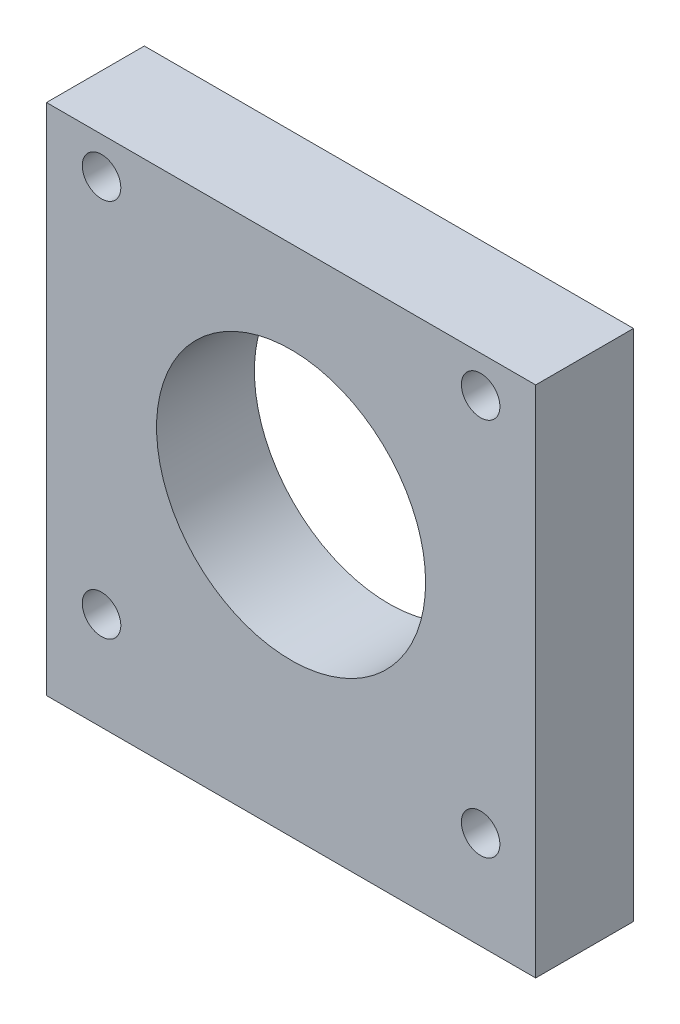
ISO-10303-21;
HEADER;
FILE_DESCRIPTION(('STEP AP214'),'2;1');
FILE_NAME('part.step','',(''),(''),'','','');
FILE_SCHEMA(('AUTOMOTIVE_DESIGN { 1 0 10303 214 1 1 1 1 }'));
ENDSEC;
DATA;
#1=APPLICATION_CONTEXT('core data for automotive mechanical design processes');
#2=APPLICATION_PROTOCOL_DEFINITION('international standard','automotive_design',2000,#1);
#3=PRODUCT_CONTEXT('',#1,'mechanical');
#4=PRODUCT('Part','Part','',(#3));
#5=PRODUCT_RELATED_PRODUCT_CATEGORY('part','',(#4));
#6=PRODUCT_DEFINITION_FORMATION('','',#4);
#7=PRODUCT_DEFINITION_CONTEXT('part definition',#1,'design');
#8=PRODUCT_DEFINITION('design','',#6,#7);
#9=PRODUCT_DEFINITION_SHAPE('','',#8);
#10=(LENGTH_UNIT() NAMED_UNIT(*) SI_UNIT(.MILLI.,.METRE.));
#11=(NAMED_UNIT(*) PLANE_ANGLE_UNIT() SI_UNIT($,.RADIAN.));
#12=(NAMED_UNIT(*) SI_UNIT($,.STERADIAN.) SOLID_ANGLE_UNIT());
#13=UNCERTAINTY_MEASURE_WITH_UNIT(LENGTH_MEASURE(1.E-05),#10,'distance_accuracy_value','');
#14=(GEOMETRIC_REPRESENTATION_CONTEXT(3) GLOBAL_UNCERTAINTY_ASSIGNED_CONTEXT((#13)) GLOBAL_UNIT_ASSIGNED_CONTEXT((#10,
#11,#12)) REPRESENTATION_CONTEXT('',''));
#15=CARTESIAN_POINT('',(0.,0.,0.));
#16=DIRECTION('',(0.,0.,1.));
#17=DIRECTION('',(1.,0.,0.));
#18=AXIS2_PLACEMENT_3D('',#15,#16,#17);
#19=CARTESIAN_POINT('',(-20.,-21.,8.));
#20=DIRECTION('',(1.,0.,0.));
#21=DIRECTION('',(0.,0.,-1.));
#22=AXIS2_PLACEMENT_3D('',#19,#20,#21);
#23=PLANE('',#22);
#24=DIRECTION('',(0.,-1.,0.));
#25=VECTOR('',#24,1.);
#26=CARTESIAN_POINT('',(-20.,-21.,0.));
#27=LINE('',#26,#25);
#28=CARTESIAN_POINT('',(-20.,21.,0.));
#29=VERTEX_POINT('',#28);
#30=CARTESIAN_POINT('',(-20.,-21.,0.));
#31=VERTEX_POINT('',#30);
#32=EDGE_CURVE('E135',#29,#31,#27,.T.);
#33=ORIENTED_EDGE('',*,*,#32,.T.);
#34=DIRECTION('',(0.,0.,-1.));
#35=VECTOR('',#34,1.);
#36=CARTESIAN_POINT('',(-20.,-21.,8.));
#37=LINE('',#36,#35);
#38=CARTESIAN_POINT('',(-20.,-21.,8.));
#39=VERTEX_POINT('',#38);
#40=EDGE_CURVE('E11',#39,#31,#37,.T.);
#41=ORIENTED_EDGE('',*,*,#40,.F.);
#42=DIRECTION('',(0.,-1.,0.));
#43=VECTOR('',#42,1.);
#44=CARTESIAN_POINT('',(-20.,-21.,8.));
#45=LINE('',#44,#43);
#46=CARTESIAN_POINT('',(-20.,21.,8.));
#47=VERTEX_POINT('',#46);
#48=EDGE_CURVE('E139',#47,#39,#45,.T.);
#49=ORIENTED_EDGE('',*,*,#48,.F.);
#50=DIRECTION('',(0.,0.,-1.));
#51=VECTOR('',#50,1.);
#52=CARTESIAN_POINT('',(-20.,21.,8.));
#53=LINE('',#52,#51);
#54=EDGE_CURVE('E149',#47,#29,#53,.T.);
#55=ORIENTED_EDGE('',*,*,#54,.T.);
#56=EDGE_LOOP('',(#33,#41,#49,#55));
#57=FACE_BOUND('',#56,.T.);
#58=ADVANCED_FACE('F44',(#57),#23,.F.);
#59=CARTESIAN_POINT('',(20.,-21.,8.));
#60=DIRECTION('',(0.,1.,0.));
#61=DIRECTION('',(-1.,0.,0.));
#62=AXIS2_PLACEMENT_3D('',#59,#60,#61);
#63=PLANE('',#62);
#64=CARTESIAN_POINT('',(12.,-21.,4.));
#65=DIRECTION('',(0.,-1.,0.));
#66=DIRECTION('',(0.,0.,-1.));
#67=AXIS2_PLACEMENT_3D('',#64,#65,#66);
#68=CIRCLE('',#67,1.883);
#69=CARTESIAN_POINT('',(12.,-21.,2.117));
#70=VERTEX_POINT('',#69);
#71=EDGE_CURVE('E119',#70,#70,#68,.T.);
#72=ORIENTED_EDGE('',*,*,#71,.F.);
#73=EDGE_LOOP('',(#72));
#74=FACE_BOUND('',#73,.T.);
#75=CARTESIAN_POINT('',(-12.,-21.,4.));
#76=DIRECTION('',(0.,-1.,0.));
#77=DIRECTION('',(0.,0.,-1.));
#78=AXIS2_PLACEMENT_3D('',#75,#76,#77);
#79=CIRCLE('',#78,1.883);
#80=CARTESIAN_POINT('',(-12.,-21.,2.117));
#81=VERTEX_POINT('',#80);
#82=EDGE_CURVE('E110',#81,#81,#79,.T.);
#83=ORIENTED_EDGE('',*,*,#82,.F.);
#84=EDGE_LOOP('',(#83));
#85=FACE_BOUND('',#84,.T.);
#86=DIRECTION('',(1.,0.,0.));
#87=VECTOR('',#86,1.);
#88=CARTESIAN_POINT('',(20.,-21.,0.));
#89=LINE('',#88,#87);
#90=CARTESIAN_POINT('',(20.,-21.,0.));
#91=VERTEX_POINT('',#90);
#92=EDGE_CURVE('E153',#31,#91,#89,.T.);
#93=ORIENTED_EDGE('',*,*,#92,.T.);
#94=DIRECTION('',(0.,0.,-1.));
#95=VECTOR('',#94,1.);
#96=CARTESIAN_POINT('',(20.,-21.,8.));
#97=LINE('',#96,#95);
#98=CARTESIAN_POINT('',(20.,-21.,8.));
#99=VERTEX_POINT('',#98);
#100=EDGE_CURVE('E53',#99,#91,#97,.T.);
#101=ORIENTED_EDGE('',*,*,#100,.F.);
#102=DIRECTION('',(1.,0.,0.));
#103=VECTOR('',#102,1.);
#104=CARTESIAN_POINT('',(20.,-21.,8.));
#105=LINE('',#104,#103);
#106=EDGE_CURVE('E92',#39,#99,#105,.T.);
#107=ORIENTED_EDGE('',*,*,#106,.F.);
#108=ORIENTED_EDGE('',*,*,#40,.T.);
#109=EDGE_LOOP('',(#93,#101,#107,#108));
#110=FACE_BOUND('',#109,.T.);
#111=ADVANCED_FACE('F183',(#74,#85,#110),#63,.F.);
#112=CARTESIAN_POINT('',(20.,-21.,8.));
#113=DIRECTION('',(-1.,0.,0.));
#114=DIRECTION('',(0.,0.,1.));
#115=AXIS2_PLACEMENT_3D('',#112,#113,#114);
#116=PLANE('',#115);
#117=DIRECTION('',(0.,1.,0.));
#118=VECTOR('',#117,1.);
#119=CARTESIAN_POINT('',(20.,-21.,0.));
#120=LINE('',#119,#118);
#121=CARTESIAN_POINT('',(20.,21.,0.));
#122=VERTEX_POINT('',#121);
#123=EDGE_CURVE('E79',#91,#122,#120,.T.);
#124=ORIENTED_EDGE('',*,*,#123,.T.);
#125=DIRECTION('',(0.,0.,-1.));
#126=VECTOR('',#125,1.);
#127=CARTESIAN_POINT('',(20.,21.,8.));
#128=LINE('',#127,#126);
#129=CARTESIAN_POINT('',(20.,21.,8.));
#130=VERTEX_POINT('',#129);
#131=EDGE_CURVE('E162',#130,#122,#128,.T.);
#132=ORIENTED_EDGE('',*,*,#131,.F.);
#133=DIRECTION('',(0.,1.,0.));
#134=VECTOR('',#133,1.);
#135=CARTESIAN_POINT('',(20.,-21.,8.));
#136=LINE('',#135,#134);
#137=EDGE_CURVE('E144',#99,#130,#136,.T.);
#138=ORIENTED_EDGE('',*,*,#137,.F.);
#139=ORIENTED_EDGE('',*,*,#100,.T.);
#140=EDGE_LOOP('',(#124,#132,#138,#139));
#141=FACE_BOUND('',#140,.T.);
#142=ADVANCED_FACE('F166',(#141),#116,.F.);
#143=CARTESIAN_POINT('',(20.,21.,8.));
#144=DIRECTION('',(0.,-1.,0.));
#145=DIRECTION('',(1.,0.,0.));
#146=AXIS2_PLACEMENT_3D('',#143,#144,#145);
#147=PLANE('',#146);
#148=DIRECTION('',(-1.,0.,0.));
#149=VECTOR('',#148,1.);
#150=CARTESIAN_POINT('',(20.,21.,0.));
#151=LINE('',#150,#149);
#152=EDGE_CURVE('E85',#122,#29,#151,.T.);
#153=ORIENTED_EDGE('',*,*,#152,.T.);
#154=ORIENTED_EDGE('',*,*,#54,.F.);
#155=DIRECTION('',(-1.,0.,0.));
#156=VECTOR('',#155,1.);
#157=CARTESIAN_POINT('',(20.,21.,8.));
#158=LINE('',#157,#156);
#159=EDGE_CURVE('E61',#130,#47,#158,.T.);
#160=ORIENTED_EDGE('',*,*,#159,.F.);
#161=ORIENTED_EDGE('',*,*,#131,.T.);
#162=EDGE_LOOP('',(#153,#154,#160,#161));
#163=FACE_BOUND('',#162,.T.);
#164=ADVANCED_FACE('F173',(#163),#147,.F.);
#165=CARTESIAN_POINT('',(0.,0.,8.));
#166=DIRECTION('',(0.,0.,1.));
#167=DIRECTION('',(1.,0.,0.));
#168=AXIS2_PLACEMENT_3D('',#165,#166,#167);
#169=PLANE('',#168);
#170=CARTESIAN_POINT('',(15.5,18.,8.));
#171=DIRECTION('',(0.,0.,-1.));
#172=DIRECTION('',(-1.,0.,0.));
#173=AXIS2_PLACEMENT_3D('',#170,#171,#172);
#174=CIRCLE('',#173,1.575);
#175=CARTESIAN_POINT('',(13.925,18.,8.));
#176=VERTEX_POINT('',#175);
#177=EDGE_CURVE('E311',#176,#176,#174,.T.);
#178=ORIENTED_EDGE('',*,*,#177,.T.);
#179=EDGE_LOOP('',(#178));
#180=FACE_BOUND('',#179,.T.);
#181=CARTESIAN_POINT('',(-15.5,18.,8.));
#182=DIRECTION('',(0.,0.,-1.));
#183=DIRECTION('',(-1.,0.,0.));
#184=AXIS2_PLACEMENT_3D('',#181,#182,#183);
#185=CIRCLE('',#184,1.575);
#186=CARTESIAN_POINT('',(-17.075,18.,8.));
#187=VERTEX_POINT('',#186);
#188=EDGE_CURVE('E323',#187,#187,#185,.T.);
#189=ORIENTED_EDGE('',*,*,#188,.T.);
#190=EDGE_LOOP('',(#189));
#191=FACE_BOUND('',#190,.T.);
#192=CARTESIAN_POINT('',(15.5,-13.,8.));
#193=DIRECTION('',(0.,0.,-1.));
#194=DIRECTION('',(-1.,0.,0.));
#195=AXIS2_PLACEMENT_3D('',#192,#193,#194);
#196=CIRCLE('',#195,1.575);
#197=CARTESIAN_POINT('',(13.925,-13.,8.));
#198=VERTEX_POINT('',#197);
#199=EDGE_CURVE('E244',#198,#198,#196,.T.);
#200=ORIENTED_EDGE('',*,*,#199,.T.);
#201=EDGE_LOOP('',(#200));
#202=FACE_BOUND('',#201,.T.);
#203=CARTESIAN_POINT('',(-15.5,-13.,8.));
#204=DIRECTION('',(0.,0.,-1.));
#205=DIRECTION('',(-1.,0.,0.));
#206=AXIS2_PLACEMENT_3D('',#203,#204,#205);
#207=CIRCLE('',#206,1.575);
#208=CARTESIAN_POINT('',(-17.075,-13.,8.));
#209=VERTEX_POINT('',#208);
#210=EDGE_CURVE('E249',#209,#209,#207,.T.);
#211=ORIENTED_EDGE('',*,*,#210,.T.);
#212=EDGE_LOOP('',(#211));
#213=FACE_BOUND('',#212,.T.);
#214=CARTESIAN_POINT('',(0.,2.49999999999999,8.));
#215=DIRECTION('',(0.,0.,1.));
#216=DIRECTION('',(1.,0.,0.));
#217=AXIS2_PLACEMENT_3D('',#214,#215,#216);
#218=CIRCLE('',#217,11.);
#219=CARTESIAN_POINT('',(11.,2.49999999999999,8.));
#220=VERTEX_POINT('',#219);
#221=EDGE_CURVE('E130',#220,#220,#218,.T.);
#222=ORIENTED_EDGE('',*,*,#221,.F.);
#223=EDGE_LOOP('',(#222));
#224=FACE_BOUND('',#223,.T.);
#225=ORIENTED_EDGE('',*,*,#48,.T.);
#226=ORIENTED_EDGE('',*,*,#106,.T.);
#227=ORIENTED_EDGE('',*,*,#137,.T.);
#228=ORIENTED_EDGE('',*,*,#159,.T.);
#229=EDGE_LOOP('',(#225,#226,#227,#228));
#230=FACE_BOUND('',#229,.T.);
#231=ADVANCED_FACE('F175',(#180,#191,#202,#213,#224,#230),#169,.T.);
#232=CARTESIAN_POINT('',(0.,0.,0.));
#233=DIRECTION('',(0.,0.,1.));
#234=DIRECTION('',(1.,0.,0.));
#235=AXIS2_PLACEMENT_3D('',#232,#233,#234);
#236=PLANE('',#235);
#237=CARTESIAN_POINT('',(15.5,18.,0.));
#238=DIRECTION('',(0.,0.,-1.));
#239=DIRECTION('',(-1.,0.,0.));
#240=AXIS2_PLACEMENT_3D('',#237,#238,#239);
#241=CIRCLE('',#240,1.883);
#242=CARTESIAN_POINT('',(13.617,18.,0.));
#243=VERTEX_POINT('',#242);
#244=EDGE_CURVE('E224',#243,#243,#241,.T.);
#245=ORIENTED_EDGE('',*,*,#244,.F.);
#246=EDGE_LOOP('',(#245));
#247=FACE_BOUND('',#246,.T.);
#248=CARTESIAN_POINT('',(-15.5,18.,0.));
#249=DIRECTION('',(0.,0.,-1.));
#250=DIRECTION('',(-1.,0.,0.));
#251=AXIS2_PLACEMENT_3D('',#248,#249,#250);
#252=CIRCLE('',#251,1.883);
#253=CARTESIAN_POINT('',(-17.383,18.,0.));
#254=VERTEX_POINT('',#253);
#255=EDGE_CURVE('E228',#254,#254,#252,.T.);
#256=ORIENTED_EDGE('',*,*,#255,.F.);
#257=EDGE_LOOP('',(#256));
#258=FACE_BOUND('',#257,.T.);
#259=CARTESIAN_POINT('',(15.5,-13.,0.));
#260=DIRECTION('',(0.,0.,-1.));
#261=DIRECTION('',(-1.,0.,0.));
#262=AXIS2_PLACEMENT_3D('',#259,#260,#261);
#263=CIRCLE('',#262,1.883);
#264=CARTESIAN_POINT('',(13.617,-13.,0.));
#265=VERTEX_POINT('',#264);
#266=EDGE_CURVE('E232',#265,#265,#263,.T.);
#267=ORIENTED_EDGE('',*,*,#266,.F.);
#268=EDGE_LOOP('',(#267));
#269=FACE_BOUND('',#268,.T.);
#270=CARTESIAN_POINT('',(-15.5,-13.,0.));
#271=DIRECTION('',(0.,0.,-1.));
#272=DIRECTION('',(-1.,0.,0.));
#273=AXIS2_PLACEMENT_3D('',#270,#271,#272);
#274=CIRCLE('',#273,1.883);
#275=CARTESIAN_POINT('',(-17.383,-13.,0.));
#276=VERTEX_POINT('',#275);
#277=EDGE_CURVE('E236',#276,#276,#274,.T.);
#278=ORIENTED_EDGE('',*,*,#277,.F.);
#279=EDGE_LOOP('',(#278));
#280=FACE_BOUND('',#279,.T.);
#281=CARTESIAN_POINT('',(0.,2.49999999999999,0.));
#282=DIRECTION('',(0.,0.,1.));
#283=DIRECTION('',(1.,0.,0.));
#284=AXIS2_PLACEMENT_3D('',#281,#282,#283);
#285=CIRCLE('',#284,11.);
#286=CARTESIAN_POINT('',(11.,2.49999999999999,0.));
#287=VERTEX_POINT('',#286);
#288=EDGE_CURVE('E131',#287,#287,#285,.T.);
#289=ORIENTED_EDGE('',*,*,#288,.T.);
#290=EDGE_LOOP('',(#289));
#291=FACE_BOUND('',#290,.T.);
#292=ORIENTED_EDGE('',*,*,#32,.F.);
#293=ORIENTED_EDGE('',*,*,#152,.F.);
#294=ORIENTED_EDGE('',*,*,#123,.F.);
#295=ORIENTED_EDGE('',*,*,#92,.F.);
#296=EDGE_LOOP('',(#292,#293,#294,#295));
#297=FACE_BOUND('',#296,.T.);
#298=ADVANCED_FACE('F169',(#247,#258,#269,#280,#291,#297),#236,.F.);
#299=CARTESIAN_POINT('',(0.,2.49999999999999,0.));
#300=DIRECTION('',(0.,0.,1.));
#301=DIRECTION('',(1.,0.,0.));
#302=AXIS2_PLACEMENT_3D('',#299,#300,#301);
#303=CYLINDRICAL_SURFACE('',#302,11.);
#304=ORIENTED_EDGE('',*,*,#288,.F.);
#305=EDGE_LOOP('',(#304));
#306=FACE_BOUND('',#305,.T.);
#307=ORIENTED_EDGE('',*,*,#221,.T.);
#308=EDGE_LOOP('',(#307));
#309=FACE_BOUND('',#308,.T.);
#310=ADVANCED_FACE('F213',(#306,#309),#303,.F.);
#311=CARTESIAN_POINT('',(-12.,-11.,4.));
#312=DIRECTION('',(0.,-1.,0.));
#313=DIRECTION('',(0.,0.,-1.));
#314=AXIS2_PLACEMENT_3D('',#311,#312,#313);
#315=CONICAL_SURFACE('',#314,1.575,1.02974425867665);
#316=CARTESIAN_POINT('',(-12.,-10.0536445250316,4.));
#317=VERTEX_POINT('',#316);
#318=VERTEX_LOOP('',#317);
#319=FACE_BOUND('',#318,.T.);
#320=CARTESIAN_POINT('',(-12.,-11.,4.));
#321=DIRECTION('',(0.,-1.,0.));
#322=DIRECTION('',(0.,0.,-1.));
#323=AXIS2_PLACEMENT_3D('',#320,#321,#322);
#324=CIRCLE('',#323,1.575);
#325=CARTESIAN_POINT('',(-12.,-11.,2.425));
#326=VERTEX_POINT('',#325);
#327=EDGE_CURVE('E126',#326,#326,#324,.T.);
#328=ORIENTED_EDGE('',*,*,#327,.T.);
#329=EDGE_LOOP('',(#328));
#330=FACE_BOUND('',#329,.T.);
#331=ADVANCED_FACE('F205',(#319,#330),#315,.F.);
#332=CARTESIAN_POINT('',(-12.,-21.,4.));
#333=DIRECTION('',(0.,-1.,0.));
#334=DIRECTION('',(0.,0.,-1.));
#335=AXIS2_PLACEMENT_3D('',#332,#333,#334);
#336=CYLINDRICAL_SURFACE('',#335,1.575);
#337=ORIENTED_EDGE('',*,*,#327,.F.);
#338=EDGE_LOOP('',(#337));
#339=FACE_BOUND('',#338,.T.);
#340=CARTESIAN_POINT('',(-12.,-20.692,4.));
#341=DIRECTION('',(0.,-1.,0.));
#342=DIRECTION('',(0.,0.,-1.));
#343=AXIS2_PLACEMENT_3D('',#340,#341,#342);
#344=CIRCLE('',#343,1.575);
#345=CARTESIAN_POINT('',(-12.,-20.692,2.425));
#346=VERTEX_POINT('',#345);
#347=EDGE_CURVE('E116',#346,#346,#344,.T.);
#348=ORIENTED_EDGE('',*,*,#347,.T.);
#349=EDGE_LOOP('',(#348));
#350=FACE_BOUND('',#349,.T.);
#351=ADVANCED_FACE('F199',(#339,#350),#336,.F.);
#352=CARTESIAN_POINT('',(-12.,-21.,4.));
#353=DIRECTION('',(0.,-1.,0.));
#354=DIRECTION('',(0.,0.,-1.));
#355=AXIS2_PLACEMENT_3D('',#352,#353,#354);
#356=CONICAL_SURFACE('',#355,1.883,0.785398163397443);
#357=ORIENTED_EDGE('',*,*,#347,.F.);
#358=EDGE_LOOP('',(#357));
#359=FACE_BOUND('',#358,.T.);
#360=ORIENTED_EDGE('',*,*,#82,.T.);
#361=EDGE_LOOP('',(#360));
#362=FACE_BOUND('',#361,.T.);
#363=ADVANCED_FACE('F103',(#359,#362),#356,.F.);
#364=CARTESIAN_POINT('',(12.,-11.,4.));
#365=DIRECTION('',(0.,-1.,0.));
#366=DIRECTION('',(0.,0.,-1.));
#367=AXIS2_PLACEMENT_3D('',#364,#365,#366);
#368=CONICAL_SURFACE('',#367,1.575,1.02974425867665);
#369=CARTESIAN_POINT('',(12.,-10.0536445250316,4.));
#370=VERTEX_POINT('',#369);
#371=VERTEX_LOOP('',#370);
#372=FACE_BOUND('',#371,.T.);
#373=CARTESIAN_POINT('',(12.,-11.,4.));
#374=DIRECTION('',(0.,-1.,0.));
#375=DIRECTION('',(0.,0.,-1.));
#376=AXIS2_PLACEMENT_3D('',#373,#374,#375);
#377=CIRCLE('',#376,1.575);
#378=CARTESIAN_POINT('',(12.,-11.,2.425));
#379=VERTEX_POINT('',#378);
#380=EDGE_CURVE('E107',#379,#379,#377,.T.);
#381=ORIENTED_EDGE('',*,*,#380,.T.);
#382=EDGE_LOOP('',(#381));
#383=FACE_BOUND('',#382,.T.);
#384=ADVANCED_FACE('F99',(#372,#383),#368,.F.);
#385=CARTESIAN_POINT('',(12.,-21.,4.));
#386=DIRECTION('',(0.,-1.,0.));
#387=DIRECTION('',(0.,0.,-1.));
#388=AXIS2_PLACEMENT_3D('',#385,#386,#387);
#389=CYLINDRICAL_SURFACE('',#388,1.575);
#390=ORIENTED_EDGE('',*,*,#380,.F.);
#391=EDGE_LOOP('',(#390));
#392=FACE_BOUND('',#391,.T.);
#393=CARTESIAN_POINT('',(12.,-20.692,4.));
#394=DIRECTION('',(0.,-1.,0.));
#395=DIRECTION('',(0.,0.,-1.));
#396=AXIS2_PLACEMENT_3D('',#393,#394,#395);
#397=CIRCLE('',#396,1.575);
#398=CARTESIAN_POINT('',(12.,-20.692,2.425));
#399=VERTEX_POINT('',#398);
#400=EDGE_CURVE('E111',#399,#399,#397,.T.);
#401=ORIENTED_EDGE('',*,*,#400,.T.);
#402=EDGE_LOOP('',(#401));
#403=FACE_BOUND('',#402,.T.);
#404=ADVANCED_FACE('F102',(#392,#403),#389,.F.);
#405=CARTESIAN_POINT('',(12.,-21.,4.));
#406=DIRECTION('',(0.,-1.,0.));
#407=DIRECTION('',(0.,0.,-1.));
#408=AXIS2_PLACEMENT_3D('',#405,#406,#407);
#409=CONICAL_SURFACE('',#408,1.883,0.785398163397443);
#410=ORIENTED_EDGE('',*,*,#400,.F.);
#411=EDGE_LOOP('',(#410));
#412=FACE_BOUND('',#411,.T.);
#413=ORIENTED_EDGE('',*,*,#71,.T.);
#414=EDGE_LOOP('',(#413));
#415=FACE_BOUND('',#414,.T.);
#416=ADVANCED_FACE('F260',(#412,#415),#409,.F.);
#417=CARTESIAN_POINT('',(-15.5,-13.,0.));
#418=DIRECTION('',(0.,0.,-1.));
#419=DIRECTION('',(-1.,0.,0.));
#420=AXIS2_PLACEMENT_3D('',#417,#418,#419);
#421=CYLINDRICAL_SURFACE('',#420,1.575);
#422=ORIENTED_EDGE('',*,*,#210,.F.);
#423=EDGE_LOOP('',(#422));
#424=FACE_BOUND('',#423,.T.);
#425=CARTESIAN_POINT('',(-15.5,-13.,0.308));
#426=DIRECTION('',(0.,0.,-1.));
#427=DIRECTION('',(-1.,0.,0.));
#428=AXIS2_PLACEMENT_3D('',#425,#426,#427);
#429=CIRCLE('',#428,1.575);
#430=CARTESIAN_POINT('',(-17.075,-13.,0.308));
#431=VERTEX_POINT('',#430);
#432=EDGE_CURVE('E243',#431,#431,#429,.T.);
#433=ORIENTED_EDGE('',*,*,#432,.T.);
#434=EDGE_LOOP('',(#433));
#435=FACE_BOUND('',#434,.T.);
#436=ADVANCED_FACE('F262',(#424,#435),#421,.F.);
#437=CARTESIAN_POINT('',(-15.5,-13.,0.));
#438=DIRECTION('',(0.,0.,-1.));
#439=DIRECTION('',(-1.,0.,0.));
#440=AXIS2_PLACEMENT_3D('',#437,#438,#439);
#441=CONICAL_SURFACE('',#440,1.883,0.785398163397444);
#442=ORIENTED_EDGE('',*,*,#432,.F.);
#443=EDGE_LOOP('',(#442));
#444=FACE_BOUND('',#443,.T.);
#445=ORIENTED_EDGE('',*,*,#277,.T.);
#446=EDGE_LOOP('',(#445));
#447=FACE_BOUND('',#446,.T.);
#448=ADVANCED_FACE('F270',(#444,#447),#441,.F.);
#449=CARTESIAN_POINT('',(15.5,-13.,0.));
#450=DIRECTION('',(0.,0.,-1.));
#451=DIRECTION('',(-1.,0.,0.));
#452=AXIS2_PLACEMENT_3D('',#449,#450,#451);
#453=CYLINDRICAL_SURFACE('',#452,1.575);
#454=ORIENTED_EDGE('',*,*,#199,.F.);
#455=EDGE_LOOP('',(#454));
#456=FACE_BOUND('',#455,.T.);
#457=CARTESIAN_POINT('',(15.5,-13.,0.308));
#458=DIRECTION('',(0.,0.,-1.));
#459=DIRECTION('',(-1.,0.,0.));
#460=AXIS2_PLACEMENT_3D('',#457,#458,#459);
#461=CIRCLE('',#460,1.575);
#462=CARTESIAN_POINT('',(13.925,-13.,0.308));
#463=VERTEX_POINT('',#462);
#464=EDGE_CURVE('E252',#463,#463,#461,.T.);
#465=ORIENTED_EDGE('',*,*,#464,.T.);
#466=EDGE_LOOP('',(#465));
#467=FACE_BOUND('',#466,.T.);
#468=ADVANCED_FACE('F277',(#456,#467),#453,.F.);
#469=CARTESIAN_POINT('',(15.5,-13.,0.));
#470=DIRECTION('',(0.,0.,-1.));
#471=DIRECTION('',(-1.,0.,0.));
#472=AXIS2_PLACEMENT_3D('',#469,#470,#471);
#473=CONICAL_SURFACE('',#472,1.883,0.785398163397444);
#474=ORIENTED_EDGE('',*,*,#464,.F.);
#475=EDGE_LOOP('',(#474));
#476=FACE_BOUND('',#475,.T.);
#477=ORIENTED_EDGE('',*,*,#266,.T.);
#478=EDGE_LOOP('',(#477));
#479=FACE_BOUND('',#478,.T.);
#480=ADVANCED_FACE('F281',(#476,#479),#473,.F.);
#481=CARTESIAN_POINT('',(-15.5,18.,0.));
#482=DIRECTION('',(0.,0.,-1.));
#483=DIRECTION('',(-1.,0.,0.));
#484=AXIS2_PLACEMENT_3D('',#481,#482,#483);
#485=CYLINDRICAL_SURFACE('',#484,1.575);
#486=ORIENTED_EDGE('',*,*,#188,.F.);
#487=EDGE_LOOP('',(#486));
#488=FACE_BOUND('',#487,.T.);
#489=CARTESIAN_POINT('',(-15.5,18.,0.308));
#490=DIRECTION('',(0.,0.,-1.));
#491=DIRECTION('',(-1.,0.,0.));
#492=AXIS2_PLACEMENT_3D('',#489,#490,#491);
#493=CIRCLE('',#492,1.575);
#494=CARTESIAN_POINT('',(-17.075,18.,0.308));
#495=VERTEX_POINT('',#494);
#496=EDGE_CURVE('E319',#495,#495,#493,.T.);
#497=ORIENTED_EDGE('',*,*,#496,.T.);
#498=EDGE_LOOP('',(#497));
#499=FACE_BOUND('',#498,.T.);
#500=ADVANCED_FACE('F285',(#488,#499),#485,.F.);
#501=CARTESIAN_POINT('',(-15.5,18.,0.));
#502=DIRECTION('',(0.,0.,-1.));
#503=DIRECTION('',(-1.,0.,0.));
#504=AXIS2_PLACEMENT_3D('',#501,#502,#503);
#505=CONICAL_SURFACE('',#504,1.883,0.785398163397447);
#506=ORIENTED_EDGE('',*,*,#496,.F.);
#507=EDGE_LOOP('',(#506));
#508=FACE_BOUND('',#507,.T.);
#509=ORIENTED_EDGE('',*,*,#255,.T.);
#510=EDGE_LOOP('',(#509));
#511=FACE_BOUND('',#510,.T.);
#512=ADVANCED_FACE('F289',(#508,#511),#505,.F.);
#513=CARTESIAN_POINT('',(15.5,18.,0.));
#514=DIRECTION('',(0.,0.,-1.));
#515=DIRECTION('',(-1.,0.,0.));
#516=AXIS2_PLACEMENT_3D('',#513,#514,#515);
#517=CYLINDRICAL_SURFACE('',#516,1.575);
#518=ORIENTED_EDGE('',*,*,#177,.F.);
#519=EDGE_LOOP('',(#518));
#520=FACE_BOUND('',#519,.T.);
#521=CARTESIAN_POINT('',(15.5,18.,0.308));
#522=DIRECTION('',(0.,0.,-1.));
#523=DIRECTION('',(-1.,0.,0.));
#524=AXIS2_PLACEMENT_3D('',#521,#522,#523);
#525=CIRCLE('',#524,1.575);
#526=CARTESIAN_POINT('',(13.925,18.,0.308));
#527=VERTEX_POINT('',#526);
#528=EDGE_CURVE('E307',#527,#527,#525,.T.);
#529=ORIENTED_EDGE('',*,*,#528,.T.);
#530=EDGE_LOOP('',(#529));
#531=FACE_BOUND('',#530,.T.);
#532=ADVANCED_FACE('F293',(#520,#531),#517,.F.);
#533=CARTESIAN_POINT('',(15.5,18.,0.));
#534=DIRECTION('',(0.,0.,-1.));
#535=DIRECTION('',(-1.,0.,0.));
#536=AXIS2_PLACEMENT_3D('',#533,#534,#535);
#537=CONICAL_SURFACE('',#536,1.883,0.78539816339745);
#538=ORIENTED_EDGE('',*,*,#528,.F.);
#539=EDGE_LOOP('',(#538));
#540=FACE_BOUND('',#539,.T.);
#541=ORIENTED_EDGE('',*,*,#244,.T.);
#542=EDGE_LOOP('',(#541));
#543=FACE_BOUND('',#542,.T.);
#544=ADVANCED_FACE('F297',(#540,#543),#537,.F.);
#545=CLOSED_SHELL('',(#58,#111,#142,#164,#231,#298,#310,#331,#351,#363,#384,#404,#416,#436,#448,
#468,#480,#500,#512,#532,#544));
#546=MANIFOLD_SOLID_BREP('B2',#545);
#547=ADVANCED_BREP_SHAPE_REPRESENTATION('',(#18,#546),#14);
#548=SHAPE_DEFINITION_REPRESENTATION(#9,#547);
ENDSEC;
END-ISO-10303-21;
